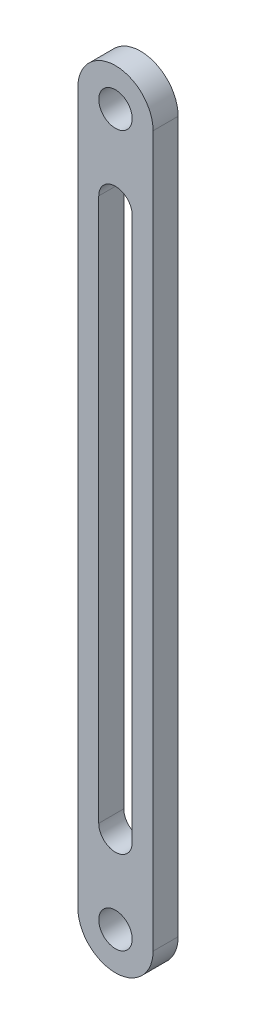
ISO-10303-21;
HEADER;
FILE_DESCRIPTION(('STEP AP214'),'2;1');
FILE_NAME('part.step','',(''),(''),'','','');
FILE_SCHEMA(('AUTOMOTIVE_DESIGN { 1 0 10303 214 1 1 1 1 }'));
ENDSEC;
DATA;
#1=APPLICATION_CONTEXT('core data for automotive mechanical design processes');
#2=APPLICATION_PROTOCOL_DEFINITION('international standard','automotive_design',2000,#1);
#3=PRODUCT_CONTEXT('',#1,'mechanical');
#4=PRODUCT('Part','Part','',(#3));
#5=PRODUCT_RELATED_PRODUCT_CATEGORY('part','',(#4));
#6=PRODUCT_DEFINITION_FORMATION('','',#4);
#7=PRODUCT_DEFINITION_CONTEXT('part definition',#1,'design');
#8=PRODUCT_DEFINITION('design','',#6,#7);
#9=PRODUCT_DEFINITION_SHAPE('','',#8);
#10=(LENGTH_UNIT() NAMED_UNIT(*) SI_UNIT(.MILLI.,.METRE.));
#11=(NAMED_UNIT(*) PLANE_ANGLE_UNIT() SI_UNIT($,.RADIAN.));
#12=(NAMED_UNIT(*) SI_UNIT($,.STERADIAN.) SOLID_ANGLE_UNIT());
#13=UNCERTAINTY_MEASURE_WITH_UNIT(LENGTH_MEASURE(1.E-05),#10,'distance_accuracy_value','');
#14=(GEOMETRIC_REPRESENTATION_CONTEXT(3) GLOBAL_UNCERTAINTY_ASSIGNED_CONTEXT((#13)) GLOBAL_UNIT_ASSIGNED_CONTEXT((#10,
#11,#12)) REPRESENTATION_CONTEXT('',''));
#15=CARTESIAN_POINT('',(0.,0.,0.));
#16=DIRECTION('',(0.,0.,1.));
#17=DIRECTION('',(1.,0.,0.));
#18=AXIS2_PLACEMENT_3D('',#15,#16,#17);
#19=CARTESIAN_POINT('',(0.,85.,3.));
#20=DIRECTION('',(0.,0.,1.));
#21=DIRECTION('',(1.,0.,0.));
#22=AXIS2_PLACEMENT_3D('',#19,#20,#21);
#23=PLANE('',#22);
#24=CARTESIAN_POINT('',(0.,85.,3.));
#25=DIRECTION('',(0.,0.,1.));
#26=DIRECTION('',(1.,0.,0.));
#27=AXIS2_PLACEMENT_3D('',#24,#25,#26);
#28=CIRCLE('',#27,2.);
#29=CARTESIAN_POINT('',(2.,85.,3.));
#30=VERTEX_POINT('',#29);
#31=EDGE_CURVE('E141',#30,#30,#28,.T.);
#32=ORIENTED_EDGE('',*,*,#31,.F.);
#33=EDGE_LOOP('',(#32));
#34=FACE_BOUND('',#33,.T.);
#35=CARTESIAN_POINT('',(0.,85.,3.));
#36=DIRECTION('',(0.,0.,1.));
#37=DIRECTION('',(1.,0.,0.));
#38=AXIS2_PLACEMENT_3D('',#35,#36,#37);
#39=CIRCLE('',#38,4.50000000000001);
#40=CARTESIAN_POINT('',(4.50000000000001,85.,3.));
#41=VERTEX_POINT('',#40);
#42=CARTESIAN_POINT('',(-4.50000000000001,85.,3.));
#43=VERTEX_POINT('',#42);
#44=EDGE_CURVE('E147',#41,#43,#39,.T.);
#45=ORIENTED_EDGE('',*,*,#44,.T.);
#46=DIRECTION('',(0.,-1.,0.));
#47=VECTOR('',#46,1.);
#48=CARTESIAN_POINT('',(-4.50000000000001,85.,3.));
#49=LINE('',#48,#47);
#50=CARTESIAN_POINT('',(-4.5,0.,3.));
#51=VERTEX_POINT('',#50);
#52=EDGE_CURVE('E150',#43,#51,#49,.T.);
#53=ORIENTED_EDGE('',*,*,#52,.T.);
#54=CARTESIAN_POINT('',(0.,0.,3.));
#55=DIRECTION('',(0.,0.,1.));
#56=DIRECTION('',(1.,0.,0.));
#57=AXIS2_PLACEMENT_3D('',#54,#55,#56);
#58=CIRCLE('',#57,4.5);
#59=CARTESIAN_POINT('',(4.5,0.,3.));
#60=VERTEX_POINT('',#59);
#61=EDGE_CURVE('E153',#51,#60,#58,.T.);
#62=ORIENTED_EDGE('',*,*,#61,.T.);
#63=DIRECTION('',(0.,1.,0.));
#64=VECTOR('',#63,1.);
#65=CARTESIAN_POINT('',(4.5,0.,3.));
#66=LINE('',#65,#64);
#67=EDGE_CURVE('E155',#60,#41,#66,.T.);
#68=ORIENTED_EDGE('',*,*,#67,.T.);
#69=EDGE_LOOP('',(#45,#53,#62,#68));
#70=FACE_BOUND('',#69,.T.);
#71=CARTESIAN_POINT('',(0.,0.,3.));
#72=DIRECTION('',(0.,0.,1.));
#73=DIRECTION('',(1.,0.,0.));
#74=AXIS2_PLACEMENT_3D('',#71,#72,#73);
#75=CIRCLE('',#74,2.);
#76=CARTESIAN_POINT('',(2.,0.,3.));
#77=VERTEX_POINT('',#76);
#78=EDGE_CURVE('E135',#77,#77,#75,.T.);
#79=ORIENTED_EDGE('',*,*,#78,.F.);
#80=EDGE_LOOP('',(#79));
#81=FACE_BOUND('',#80,.T.);
#82=DIRECTION('',(0.,-1.,0.));
#83=VECTOR('',#82,1.);
#84=CARTESIAN_POINT('',(-2.00000000000001,75.,3.));
#85=LINE('',#84,#83);
#86=CARTESIAN_POINT('',(-2.00000000000001,75.,3.));
#87=VERTEX_POINT('',#86);
#88=CARTESIAN_POINT('',(-2.,9.99999999999999,3.));
#89=VERTEX_POINT('',#88);
#90=EDGE_CURVE('E107',#87,#89,#85,.T.);
#91=ORIENTED_EDGE('',*,*,#90,.F.);
#92=CARTESIAN_POINT('',(0.,75.,3.));
#93=DIRECTION('',(0.,0.,1.));
#94=DIRECTION('',(1.,0.,0.));
#95=AXIS2_PLACEMENT_3D('',#92,#93,#94);
#96=CIRCLE('',#95,2.00000000000001);
#97=CARTESIAN_POINT('',(2.00000000000001,75.,3.));
#98=VERTEX_POINT('',#97);
#99=EDGE_CURVE('E99',#98,#87,#96,.T.);
#100=ORIENTED_EDGE('',*,*,#99,.F.);
#101=DIRECTION('',(0.,1.,0.));
#102=VECTOR('',#101,1.);
#103=CARTESIAN_POINT('',(2.,9.99999999999999,3.));
#104=LINE('',#103,#102);
#105=CARTESIAN_POINT('',(2.,9.99999999999999,3.));
#106=VERTEX_POINT('',#105);
#107=EDGE_CURVE('E121',#106,#98,#104,.T.);
#108=ORIENTED_EDGE('',*,*,#107,.F.);
#109=CARTESIAN_POINT('',(0.,9.99999999999999,3.));
#110=DIRECTION('',(0.,0.,1.));
#111=DIRECTION('',(1.,0.,0.));
#112=AXIS2_PLACEMENT_3D('',#109,#110,#111);
#113=CIRCLE('',#112,2.);
#114=EDGE_CURVE('E119',#89,#106,#113,.T.);
#115=ORIENTED_EDGE('',*,*,#114,.F.);
#116=EDGE_LOOP('',(#91,#100,#108,#115));
#117=FACE_BOUND('',#116,.T.);
#118=ADVANCED_FACE('F34',(#34,#70,#81,#117),#23,.T.);
#119=CARTESIAN_POINT('',(0.,85.,0.));
#120=DIRECTION('',(0.,0.,1.));
#121=DIRECTION('',(1.,0.,0.));
#122=AXIS2_PLACEMENT_3D('',#119,#120,#121);
#123=PLANE('',#122);
#124=CARTESIAN_POINT('',(0.,0.,0.));
#125=DIRECTION('',(0.,0.,1.));
#126=DIRECTION('',(1.,0.,0.));
#127=AXIS2_PLACEMENT_3D('',#124,#125,#126);
#128=CIRCLE('',#127,2.);
#129=CARTESIAN_POINT('',(2.,0.,0.));
#130=VERTEX_POINT('',#129);
#131=EDGE_CURVE('E115',#130,#130,#128,.T.);
#132=ORIENTED_EDGE('',*,*,#131,.T.);
#133=EDGE_LOOP('',(#132));
#134=FACE_BOUND('',#133,.T.);
#135=CARTESIAN_POINT('',(0.,85.,0.));
#136=DIRECTION('',(0.,0.,1.));
#137=DIRECTION('',(1.,0.,0.));
#138=AXIS2_PLACEMENT_3D('',#135,#136,#137);
#139=CIRCLE('',#138,2.);
#140=CARTESIAN_POINT('',(2.,85.,0.));
#141=VERTEX_POINT('',#140);
#142=EDGE_CURVE('E138',#141,#141,#139,.T.);
#143=ORIENTED_EDGE('',*,*,#142,.T.);
#144=EDGE_LOOP('',(#143));
#145=FACE_BOUND('',#144,.T.);
#146=CARTESIAN_POINT('',(0.,85.,0.));
#147=DIRECTION('',(0.,0.,1.));
#148=DIRECTION('',(1.,0.,0.));
#149=AXIS2_PLACEMENT_3D('',#146,#147,#148);
#150=CIRCLE('',#149,4.50000000000001);
#151=CARTESIAN_POINT('',(4.50000000000001,85.,0.));
#152=VERTEX_POINT('',#151);
#153=CARTESIAN_POINT('',(-4.50000000000001,85.,0.));
#154=VERTEX_POINT('',#153);
#155=EDGE_CURVE('E144',#152,#154,#150,.T.);
#156=ORIENTED_EDGE('',*,*,#155,.F.);
#157=DIRECTION('',(0.,1.,0.));
#158=VECTOR('',#157,1.);
#159=CARTESIAN_POINT('',(4.5,0.,0.));
#160=LINE('',#159,#158);
#161=CARTESIAN_POINT('',(4.5,0.,0.));
#162=VERTEX_POINT('',#161);
#163=EDGE_CURVE('E151',#162,#152,#160,.T.);
#164=ORIENTED_EDGE('',*,*,#163,.F.);
#165=CARTESIAN_POINT('',(0.,0.,0.));
#166=DIRECTION('',(0.,0.,1.));
#167=DIRECTION('',(1.,0.,0.));
#168=AXIS2_PLACEMENT_3D('',#165,#166,#167);
#169=CIRCLE('',#168,4.5);
#170=CARTESIAN_POINT('',(-4.5,0.,0.));
#171=VERTEX_POINT('',#170);
#172=EDGE_CURVE('E162',#171,#162,#169,.T.);
#173=ORIENTED_EDGE('',*,*,#172,.F.);
#174=DIRECTION('',(0.,-1.,0.));
#175=VECTOR('',#174,1.);
#176=CARTESIAN_POINT('',(-4.50000000000001,85.,0.));
#177=LINE('',#176,#175);
#178=EDGE_CURVE('E160',#154,#171,#177,.T.);
#179=ORIENTED_EDGE('',*,*,#178,.F.);
#180=EDGE_LOOP('',(#156,#164,#173,#179));
#181=FACE_BOUND('',#180,.T.);
#182=CARTESIAN_POINT('',(0.,75.,0.));
#183=DIRECTION('',(0.,0.,1.));
#184=DIRECTION('',(1.,0.,0.));
#185=AXIS2_PLACEMENT_3D('',#182,#183,#184);
#186=CIRCLE('',#185,2.00000000000001);
#187=CARTESIAN_POINT('',(2.00000000000001,75.,0.));
#188=VERTEX_POINT('',#187);
#189=CARTESIAN_POINT('',(-2.00000000000001,75.,0.));
#190=VERTEX_POINT('',#189);
#191=EDGE_CURVE('E57',#188,#190,#186,.T.);
#192=ORIENTED_EDGE('',*,*,#191,.T.);
#193=DIRECTION('',(0.,-1.,0.));
#194=VECTOR('',#193,1.);
#195=CARTESIAN_POINT('',(-2.00000000000001,75.,0.));
#196=LINE('',#195,#194);
#197=CARTESIAN_POINT('',(-2.,9.99999999999999,0.));
#198=VERTEX_POINT('',#197);
#199=EDGE_CURVE('E114',#190,#198,#196,.T.);
#200=ORIENTED_EDGE('',*,*,#199,.T.);
#201=CARTESIAN_POINT('',(0.,9.99999999999999,0.));
#202=DIRECTION('',(0.,0.,1.));
#203=DIRECTION('',(1.,0.,0.));
#204=AXIS2_PLACEMENT_3D('',#201,#202,#203);
#205=CIRCLE('',#204,2.);
#206=CARTESIAN_POINT('',(2.,9.99999999999999,0.));
#207=VERTEX_POINT('',#206);
#208=EDGE_CURVE('E127',#198,#207,#205,.T.);
#209=ORIENTED_EDGE('',*,*,#208,.T.);
#210=DIRECTION('',(0.,1.,0.));
#211=VECTOR('',#210,1.);
#212=CARTESIAN_POINT('',(2.,9.99999999999999,0.));
#213=LINE('',#212,#211);
#214=EDGE_CURVE('E108',#207,#188,#213,.T.);
#215=ORIENTED_EDGE('',*,*,#214,.T.);
#216=EDGE_LOOP('',(#192,#200,#209,#215));
#217=FACE_BOUND('',#216,.T.);
#218=ADVANCED_FACE('F180',(#134,#145,#181,#217),#123,.F.);
#219=CARTESIAN_POINT('',(0.,85.,3.));
#220=DIRECTION('',(0.,0.,-1.));
#221=DIRECTION('',(-1.,0.,0.));
#222=AXIS2_PLACEMENT_3D('',#219,#220,#221);
#223=CYLINDRICAL_SURFACE('',#222,4.50000000000001);
#224=ORIENTED_EDGE('',*,*,#155,.T.);
#225=DIRECTION('',(0.,0.,-1.));
#226=VECTOR('',#225,1.);
#227=CARTESIAN_POINT('',(-4.50000000000001,85.,3.));
#228=LINE('',#227,#226);
#229=EDGE_CURVE('E11',#43,#154,#228,.T.);
#230=ORIENTED_EDGE('',*,*,#229,.F.);
#231=ORIENTED_EDGE('',*,*,#44,.F.);
#232=DIRECTION('',(0.,0.,-1.));
#233=VECTOR('',#232,1.);
#234=CARTESIAN_POINT('',(4.50000000000001,85.,3.));
#235=LINE('',#234,#233);
#236=EDGE_CURVE('E157',#41,#152,#235,.T.);
#237=ORIENTED_EDGE('',*,*,#236,.T.);
#238=EDGE_LOOP('',(#224,#230,#231,#237));
#239=FACE_BOUND('',#238,.T.);
#240=ADVANCED_FACE('F36',(#239),#223,.T.);
#241=CARTESIAN_POINT('',(-4.50000000000001,85.,3.));
#242=DIRECTION('',(1.,0.,0.));
#243=DIRECTION('',(0.,1.,0.));
#244=AXIS2_PLACEMENT_3D('',#241,#242,#243);
#245=PLANE('',#244);
#246=ORIENTED_EDGE('',*,*,#178,.T.);
#247=DIRECTION('',(0.,0.,-1.));
#248=VECTOR('',#247,1.);
#249=CARTESIAN_POINT('',(-4.5,0.,3.));
#250=LINE('',#249,#248);
#251=EDGE_CURVE('E42',#51,#171,#250,.T.);
#252=ORIENTED_EDGE('',*,*,#251,.F.);
#253=ORIENTED_EDGE('',*,*,#52,.F.);
#254=ORIENTED_EDGE('',*,*,#229,.T.);
#255=EDGE_LOOP('',(#246,#252,#253,#254));
#256=FACE_BOUND('',#255,.T.);
#257=ADVANCED_FACE('F191',(#256),#245,.F.);
#258=CARTESIAN_POINT('',(0.,0.,3.));
#259=DIRECTION('',(0.,0.,-1.));
#260=DIRECTION('',(-1.,0.,0.));
#261=AXIS2_PLACEMENT_3D('',#258,#259,#260);
#262=CYLINDRICAL_SURFACE('',#261,4.5);
#263=ORIENTED_EDGE('',*,*,#172,.T.);
#264=DIRECTION('',(0.,0.,-1.));
#265=VECTOR('',#264,1.);
#266=CARTESIAN_POINT('',(4.5,0.,3.));
#267=LINE('',#266,#265);
#268=EDGE_CURVE('E167',#60,#162,#267,.T.);
#269=ORIENTED_EDGE('',*,*,#268,.F.);
#270=ORIENTED_EDGE('',*,*,#61,.F.);
#271=ORIENTED_EDGE('',*,*,#251,.T.);
#272=EDGE_LOOP('',(#263,#269,#270,#271));
#273=FACE_BOUND('',#272,.T.);
#274=ADVANCED_FACE('F174',(#273),#262,.T.);
#275=CARTESIAN_POINT('',(4.5,0.,3.));
#276=DIRECTION('',(-1.,0.,0.));
#277=DIRECTION('',(0.,-1.,0.));
#278=AXIS2_PLACEMENT_3D('',#275,#276,#277);
#279=PLANE('',#278);
#280=ORIENTED_EDGE('',*,*,#163,.T.);
#281=ORIENTED_EDGE('',*,*,#236,.F.);
#282=ORIENTED_EDGE('',*,*,#67,.F.);
#283=ORIENTED_EDGE('',*,*,#268,.T.);
#284=EDGE_LOOP('',(#280,#281,#282,#283));
#285=FACE_BOUND('',#284,.T.);
#286=ADVANCED_FACE('F184',(#285),#279,.F.);
#287=CARTESIAN_POINT('',(0.,85.,3.));
#288=DIRECTION('',(0.,0.,-1.));
#289=DIRECTION('',(-1.,0.,0.));
#290=AXIS2_PLACEMENT_3D('',#287,#288,#289);
#291=CYLINDRICAL_SURFACE('',#290,2.);
#292=ORIENTED_EDGE('',*,*,#31,.T.);
#293=EDGE_LOOP('',(#292));
#294=FACE_BOUND('',#293,.T.);
#295=ORIENTED_EDGE('',*,*,#142,.F.);
#296=EDGE_LOOP('',(#295));
#297=FACE_BOUND('',#296,.T.);
#298=ADVANCED_FACE('F208',(#294,#297),#291,.F.);
#299=CARTESIAN_POINT('',(0.,0.,3.));
#300=DIRECTION('',(0.,0.,-1.));
#301=DIRECTION('',(-1.,0.,0.));
#302=AXIS2_PLACEMENT_3D('',#299,#300,#301);
#303=CYLINDRICAL_SURFACE('',#302,2.);
#304=ORIENTED_EDGE('',*,*,#78,.T.);
#305=EDGE_LOOP('',(#304));
#306=FACE_BOUND('',#305,.T.);
#307=ORIENTED_EDGE('',*,*,#131,.F.);
#308=EDGE_LOOP('',(#307));
#309=FACE_BOUND('',#308,.T.);
#310=ADVANCED_FACE('F215',(#306,#309),#303,.F.);
#311=CARTESIAN_POINT('',(0.,75.,3.));
#312=DIRECTION('',(0.,0.,-1.));
#313=DIRECTION('',(-1.,0.,0.));
#314=AXIS2_PLACEMENT_3D('',#311,#312,#313);
#315=CYLINDRICAL_SURFACE('',#314,2.00000000000001);
#316=ORIENTED_EDGE('',*,*,#191,.F.);
#317=DIRECTION('',(0.,0.,-1.));
#318=VECTOR('',#317,1.);
#319=CARTESIAN_POINT('',(2.00000000000001,75.,3.));
#320=LINE('',#319,#318);
#321=EDGE_CURVE('E103',#98,#188,#320,.T.);
#322=ORIENTED_EDGE('',*,*,#321,.F.);
#323=ORIENTED_EDGE('',*,*,#99,.T.);
#324=DIRECTION('',(0.,0.,-1.));
#325=VECTOR('',#324,1.);
#326=CARTESIAN_POINT('',(-2.00000000000001,75.,3.));
#327=LINE('',#326,#325);
#328=EDGE_CURVE('E102',#87,#190,#327,.T.);
#329=ORIENTED_EDGE('',*,*,#328,.T.);
#330=EDGE_LOOP('',(#316,#322,#323,#329));
#331=FACE_BOUND('',#330,.T.);
#332=ADVANCED_FACE('F101',(#331),#315,.F.);
#333=CARTESIAN_POINT('',(-2.00000000000001,75.,3.));
#334=DIRECTION('',(1.,0.,0.));
#335=DIRECTION('',(0.,1.,0.));
#336=AXIS2_PLACEMENT_3D('',#333,#334,#335);
#337=PLANE('',#336);
#338=ORIENTED_EDGE('',*,*,#199,.F.);
#339=ORIENTED_EDGE('',*,*,#328,.F.);
#340=ORIENTED_EDGE('',*,*,#90,.T.);
#341=DIRECTION('',(0.,0.,-1.));
#342=VECTOR('',#341,1.);
#343=CARTESIAN_POINT('',(-2.,9.99999999999999,3.));
#344=LINE('',#343,#342);
#345=EDGE_CURVE('E116',#89,#198,#344,.T.);
#346=ORIENTED_EDGE('',*,*,#345,.T.);
#347=EDGE_LOOP('',(#338,#339,#340,#346));
#348=FACE_BOUND('',#347,.T.);
#349=ADVANCED_FACE('F111',(#348),#337,.T.);
#350=CARTESIAN_POINT('',(0.,9.99999999999999,3.));
#351=DIRECTION('',(0.,0.,-1.));
#352=DIRECTION('',(-1.,0.,0.));
#353=AXIS2_PLACEMENT_3D('',#350,#351,#352);
#354=CYLINDRICAL_SURFACE('',#353,2.);
#355=ORIENTED_EDGE('',*,*,#208,.F.);
#356=ORIENTED_EDGE('',*,*,#345,.F.);
#357=ORIENTED_EDGE('',*,*,#114,.T.);
#358=DIRECTION('',(0.,0.,-1.));
#359=VECTOR('',#358,1.);
#360=CARTESIAN_POINT('',(2.,9.99999999999999,3.));
#361=LINE('',#360,#359);
#362=EDGE_CURVE('E49',#106,#207,#361,.T.);
#363=ORIENTED_EDGE('',*,*,#362,.T.);
#364=EDGE_LOOP('',(#355,#356,#357,#363));
#365=FACE_BOUND('',#364,.T.);
#366=ADVANCED_FACE('F232',(#365),#354,.F.);
#367=CARTESIAN_POINT('',(2.,9.99999999999999,3.));
#368=DIRECTION('',(-1.,0.,0.));
#369=DIRECTION('',(0.,-1.,0.));
#370=AXIS2_PLACEMENT_3D('',#367,#368,#369);
#371=PLANE('',#370);
#372=ORIENTED_EDGE('',*,*,#214,.F.);
#373=ORIENTED_EDGE('',*,*,#362,.F.);
#374=ORIENTED_EDGE('',*,*,#107,.T.);
#375=ORIENTED_EDGE('',*,*,#321,.T.);
#376=EDGE_LOOP('',(#372,#373,#374,#375));
#377=FACE_BOUND('',#376,.T.);
#378=ADVANCED_FACE('F235',(#377),#371,.T.);
#379=CLOSED_SHELL('',(#118,#218,#240,#257,#274,#286,#298,#310,#332,#349,#366,#378));
#380=MANIFOLD_SOLID_BREP('B2',#379);
#381=ADVANCED_BREP_SHAPE_REPRESENTATION('',(#18,#380),#14);
#382=SHAPE_DEFINITION_REPRESENTATION(#9,#381);
ENDSEC;
END-ISO-10303-21;
